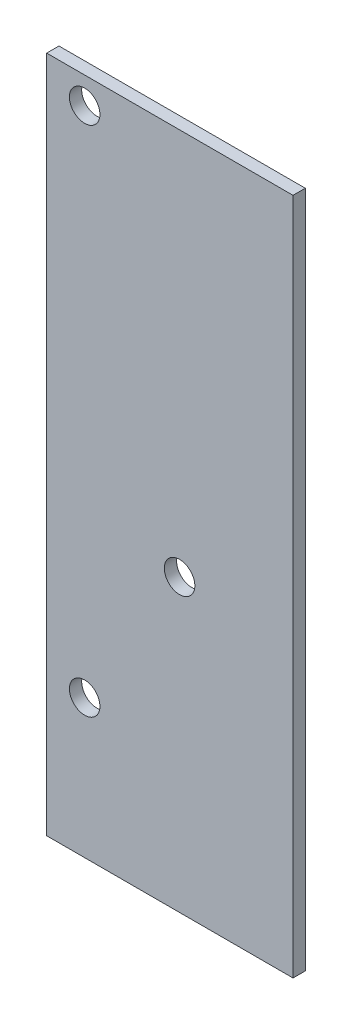
ISO-10303-21;
HEADER;
FILE_DESCRIPTION(('STEP AP214'),'2;1');
FILE_NAME('part.step','',(''),(''),'','','');
FILE_SCHEMA(('AUTOMOTIVE_DESIGN { 1 0 10303 214 1 1 1 1 }'));
ENDSEC;
DATA;
#1=APPLICATION_CONTEXT('core data for automotive mechanical design processes');
#2=APPLICATION_PROTOCOL_DEFINITION('international standard','automotive_design',2000,#1);
#3=PRODUCT_CONTEXT('',#1,'mechanical');
#4=PRODUCT('Part','Part','',(#3));
#5=PRODUCT_RELATED_PRODUCT_CATEGORY('part','',(#4));
#6=PRODUCT_DEFINITION_FORMATION('','',#4);
#7=PRODUCT_DEFINITION_CONTEXT('part definition',#1,'design');
#8=PRODUCT_DEFINITION('design','',#6,#7);
#9=PRODUCT_DEFINITION_SHAPE('','',#8);
#10=(LENGTH_UNIT() NAMED_UNIT(*) SI_UNIT(.MILLI.,.METRE.));
#11=(NAMED_UNIT(*) PLANE_ANGLE_UNIT() SI_UNIT($,.RADIAN.));
#12=(NAMED_UNIT(*) SI_UNIT($,.STERADIAN.) SOLID_ANGLE_UNIT());
#13=UNCERTAINTY_MEASURE_WITH_UNIT(LENGTH_MEASURE(1.E-05),#10,'distance_accuracy_value','');
#14=(GEOMETRIC_REPRESENTATION_CONTEXT(3) GLOBAL_UNCERTAINTY_ASSIGNED_CONTEXT((#13)) GLOBAL_UNIT_ASSIGNED_CONTEXT((#10,
#11,#12)) REPRESENTATION_CONTEXT('',''));
#15=CARTESIAN_POINT('',(0.,0.,0.));
#16=DIRECTION('',(0.,0.,1.));
#17=DIRECTION('',(1.,0.,0.));
#18=AXIS2_PLACEMENT_3D('',#15,#16,#17);
#19=CARTESIAN_POINT('',(-20.5994,-56.6801,2.05486));
#20=DIRECTION('',(1.,0.,0.));
#21=DIRECTION('',(0.,0.,-1.));
#22=AXIS2_PLACEMENT_3D('',#19,#20,#21);
#23=PLANE('',#22);
#24=DIRECTION('',(0.,-1.,0.));
#25=VECTOR('',#24,1.);
#26=CARTESIAN_POINT('',(-20.5994,-56.6801,0.));
#27=LINE('',#26,#25);
#28=CARTESIAN_POINT('',(-20.5994,56.6801,0.));
#29=VERTEX_POINT('',#28);
#30=CARTESIAN_POINT('',(-20.5994,-56.6801,0.));
#31=VERTEX_POINT('',#30);
#32=EDGE_CURVE('E97',#29,#31,#27,.T.);
#33=ORIENTED_EDGE('',*,*,#32,.T.);
#34=DIRECTION('',(0.,0.,-1.));
#35=VECTOR('',#34,1.);
#36=CARTESIAN_POINT('',(-20.5994,-56.6801,2.05486));
#37=LINE('',#36,#35);
#38=CARTESIAN_POINT('',(-20.5994,-56.6801,2.05486));
#39=VERTEX_POINT('',#38);
#40=EDGE_CURVE('E11',#39,#31,#37,.T.);
#41=ORIENTED_EDGE('',*,*,#40,.F.);
#42=DIRECTION('',(0.,-1.,0.));
#43=VECTOR('',#42,1.);
#44=CARTESIAN_POINT('',(-20.5994,-56.6801,2.05486));
#45=LINE('',#44,#43);
#46=CARTESIAN_POINT('',(-20.5994,56.6801,2.05486));
#47=VERTEX_POINT('',#46);
#48=EDGE_CURVE('E85',#47,#39,#45,.T.);
#49=ORIENTED_EDGE('',*,*,#48,.F.);
#50=DIRECTION('',(0.,0.,-1.));
#51=VECTOR('',#50,1.);
#52=CARTESIAN_POINT('',(-20.5994,56.6801,2.05486));
#53=LINE('',#52,#51);
#54=EDGE_CURVE('E93',#47,#29,#53,.T.);
#55=ORIENTED_EDGE('',*,*,#54,.T.);
#56=EDGE_LOOP('',(#33,#41,#49,#55));
#57=FACE_BOUND('',#56,.T.);
#58=ADVANCED_FACE('F34',(#57),#23,.F.);
#59=CARTESIAN_POINT('',(20.5994,-56.6801,2.05486));
#60=DIRECTION('',(0.,1.,0.));
#61=DIRECTION('',(0.,0.,1.));
#62=AXIS2_PLACEMENT_3D('',#59,#60,#61);
#63=PLANE('',#62);
#64=DIRECTION('',(1.,0.,0.));
#65=VECTOR('',#64,1.);
#66=CARTESIAN_POINT('',(20.5994,-56.6801,0.));
#67=LINE('',#66,#65);
#68=CARTESIAN_POINT('',(20.5994,-56.6801,0.));
#69=VERTEX_POINT('',#68);
#70=EDGE_CURVE('E89',#31,#69,#67,.T.);
#71=ORIENTED_EDGE('',*,*,#70,.T.);
#72=DIRECTION('',(0.,0.,-1.));
#73=VECTOR('',#72,1.);
#74=CARTESIAN_POINT('',(20.5994,-56.6801,2.05486));
#75=LINE('',#74,#73);
#76=CARTESIAN_POINT('',(20.5994,-56.6801,2.05486));
#77=VERTEX_POINT('',#76);
#78=EDGE_CURVE('E42',#77,#69,#75,.T.);
#79=ORIENTED_EDGE('',*,*,#78,.F.);
#80=DIRECTION('',(1.,0.,0.));
#81=VECTOR('',#80,1.);
#82=CARTESIAN_POINT('',(20.5994,-56.6801,2.05486));
#83=LINE('',#82,#81);
#84=EDGE_CURVE('E80',#39,#77,#83,.T.);
#85=ORIENTED_EDGE('',*,*,#84,.F.);
#86=ORIENTED_EDGE('',*,*,#40,.T.);
#87=EDGE_LOOP('',(#71,#79,#85,#86));
#88=FACE_BOUND('',#87,.T.);
#89=ADVANCED_FACE('F88',(#88),#63,.F.);
#90=CARTESIAN_POINT('',(20.5994,-56.6801,2.05486));
#91=DIRECTION('',(-1.,0.,0.));
#92=DIRECTION('',(0.,0.,1.));
#93=AXIS2_PLACEMENT_3D('',#90,#91,#92);
#94=PLANE('',#93);
#95=DIRECTION('',(0.,1.,0.));
#96=VECTOR('',#95,1.);
#97=CARTESIAN_POINT('',(20.5994,-56.6801,0.));
#98=LINE('',#97,#96);
#99=CARTESIAN_POINT('',(20.5994,56.6801,0.));
#100=VERTEX_POINT('',#99);
#101=EDGE_CURVE('E67',#69,#100,#98,.T.);
#102=ORIENTED_EDGE('',*,*,#101,.T.);
#103=DIRECTION('',(0.,0.,-1.));
#104=VECTOR('',#103,1.);
#105=CARTESIAN_POINT('',(20.5994,56.6801,2.05486));
#106=LINE('',#105,#104);
#107=CARTESIAN_POINT('',(20.5994,56.6801,2.05486));
#108=VERTEX_POINT('',#107);
#109=EDGE_CURVE('E90',#108,#100,#106,.T.);
#110=ORIENTED_EDGE('',*,*,#109,.F.);
#111=DIRECTION('',(0.,1.,0.));
#112=VECTOR('',#111,1.);
#113=CARTESIAN_POINT('',(20.5994,-56.6801,2.05486));
#114=LINE('',#113,#112);
#115=EDGE_CURVE('E83',#77,#108,#114,.T.);
#116=ORIENTED_EDGE('',*,*,#115,.F.);
#117=ORIENTED_EDGE('',*,*,#78,.T.);
#118=EDGE_LOOP('',(#102,#110,#116,#117));
#119=FACE_BOUND('',#118,.T.);
#120=ADVANCED_FACE('F91',(#119),#94,.F.);
#121=CARTESIAN_POINT('',(20.5994,56.6801,2.05486));
#122=DIRECTION('',(0.,-1.,0.));
#123=DIRECTION('',(0.,0.,-1.));
#124=AXIS2_PLACEMENT_3D('',#121,#122,#123);
#125=PLANE('',#124);
#126=DIRECTION('',(-1.,0.,0.));
#127=VECTOR('',#126,1.);
#128=CARTESIAN_POINT('',(20.5994,56.6801,0.));
#129=LINE('',#128,#127);
#130=EDGE_CURVE('E73',#100,#29,#129,.T.);
#131=ORIENTED_EDGE('',*,*,#130,.T.);
#132=ORIENTED_EDGE('',*,*,#54,.F.);
#133=DIRECTION('',(-1.,0.,0.));
#134=VECTOR('',#133,1.);
#135=CARTESIAN_POINT('',(20.5994,56.6801,2.05486));
#136=LINE('',#135,#134);
#137=EDGE_CURVE('E50',#108,#47,#136,.T.);
#138=ORIENTED_EDGE('',*,*,#137,.F.);
#139=ORIENTED_EDGE('',*,*,#109,.T.);
#140=EDGE_LOOP('',(#131,#132,#138,#139));
#141=FACE_BOUND('',#140,.T.);
#142=ADVANCED_FACE('F105',(#141),#125,.F.);
#143=CARTESIAN_POINT('',(0.,0.,2.05486));
#144=DIRECTION('',(0.,0.,1.));
#145=DIRECTION('',(1.,0.,0.));
#146=AXIS2_PLACEMENT_3D('',#143,#144,#145);
#147=PLANE('',#146);
#148=CARTESIAN_POINT('',(-14.2494,52.2351,2.05486));
#149=DIRECTION('',(0.,0.,1.));
#150=DIRECTION('',(1.,0.,0.));
#151=AXIS2_PLACEMENT_3D('',#148,#149,#150);
#152=CIRCLE('',#151,2.5527);
#153=CARTESIAN_POINT('',(-11.6967,52.2351,2.05486));
#154=VERTEX_POINT('',#153);
#155=EDGE_CURVE('E125',#154,#154,#152,.T.);
#156=ORIENTED_EDGE('',*,*,#155,.F.);
#157=EDGE_LOOP('',(#156));
#158=FACE_BOUND('',#157,.T.);
#159=CARTESIAN_POINT('',(1.6256,-8.08990000000001,2.05486));
#160=DIRECTION('',(0.,0.,1.));
#161=DIRECTION('',(1.,0.,0.));
#162=AXIS2_PLACEMENT_3D('',#159,#160,#161);
#163=CIRCLE('',#162,2.5527);
#164=CARTESIAN_POINT('',(4.1783,-8.08990000000001,2.05486));
#165=VERTEX_POINT('',#164);
#166=EDGE_CURVE('E119',#165,#165,#163,.T.);
#167=ORIENTED_EDGE('',*,*,#166,.F.);
#168=EDGE_LOOP('',(#167));
#169=FACE_BOUND('',#168,.T.);
#170=CARTESIAN_POINT('',(-14.2494,-33.4899,2.05486));
#171=DIRECTION('',(0.,0.,1.));
#172=DIRECTION('',(1.,0.,0.));
#173=AXIS2_PLACEMENT_3D('',#170,#171,#172);
#174=CIRCLE('',#173,2.5527);
#175=CARTESIAN_POINT('',(-11.6967,-33.4899,2.05486));
#176=VERTEX_POINT('',#175);
#177=EDGE_CURVE('E113',#176,#176,#174,.T.);
#178=ORIENTED_EDGE('',*,*,#177,.F.);
#179=EDGE_LOOP('',(#178));
#180=FACE_BOUND('',#179,.T.);
#181=ORIENTED_EDGE('',*,*,#48,.T.);
#182=ORIENTED_EDGE('',*,*,#84,.T.);
#183=ORIENTED_EDGE('',*,*,#115,.T.);
#184=ORIENTED_EDGE('',*,*,#137,.T.);
#185=EDGE_LOOP('',(#181,#182,#183,#184));
#186=FACE_BOUND('',#185,.T.);
#187=ADVANCED_FACE('F81',(#158,#169,#180,#186),#147,.T.);
#188=CARTESIAN_POINT('',(0.,0.,0.));
#189=DIRECTION('',(0.,0.,1.));
#190=DIRECTION('',(1.,0.,0.));
#191=AXIS2_PLACEMENT_3D('',#188,#189,#190);
#192=PLANE('',#191);
#193=CARTESIAN_POINT('',(-14.2494,52.2351,0.));
#194=DIRECTION('',(0.,0.,1.));
#195=DIRECTION('',(1.,0.,0.));
#196=AXIS2_PLACEMENT_3D('',#193,#194,#195);
#197=CIRCLE('',#196,2.5527);
#198=CARTESIAN_POINT('',(-11.6967,52.2351,0.));
#199=VERTEX_POINT('',#198);
#200=EDGE_CURVE('E122',#199,#199,#197,.T.);
#201=ORIENTED_EDGE('',*,*,#200,.T.);
#202=EDGE_LOOP('',(#201));
#203=FACE_BOUND('',#202,.T.);
#204=CARTESIAN_POINT('',(1.6256,-8.08990000000001,0.));
#205=DIRECTION('',(0.,0.,1.));
#206=DIRECTION('',(1.,0.,0.));
#207=AXIS2_PLACEMENT_3D('',#204,#205,#206);
#208=CIRCLE('',#207,2.5527);
#209=CARTESIAN_POINT('',(4.1783,-8.08990000000001,0.));
#210=VERTEX_POINT('',#209);
#211=EDGE_CURVE('E116',#210,#210,#208,.T.);
#212=ORIENTED_EDGE('',*,*,#211,.T.);
#213=EDGE_LOOP('',(#212));
#214=FACE_BOUND('',#213,.T.);
#215=CARTESIAN_POINT('',(-14.2494,-33.4899,0.));
#216=DIRECTION('',(0.,0.,1.));
#217=DIRECTION('',(1.,0.,0.));
#218=AXIS2_PLACEMENT_3D('',#215,#216,#217);
#219=CIRCLE('',#218,2.5527);
#220=CARTESIAN_POINT('',(-11.6967,-33.4899,0.));
#221=VERTEX_POINT('',#220);
#222=EDGE_CURVE('E100',#221,#221,#219,.T.);
#223=ORIENTED_EDGE('',*,*,#222,.T.);
#224=EDGE_LOOP('',(#223));
#225=FACE_BOUND('',#224,.T.);
#226=ORIENTED_EDGE('',*,*,#32,.F.);
#227=ORIENTED_EDGE('',*,*,#130,.F.);
#228=ORIENTED_EDGE('',*,*,#101,.F.);
#229=ORIENTED_EDGE('',*,*,#70,.F.);
#230=EDGE_LOOP('',(#226,#227,#228,#229));
#231=FACE_BOUND('',#230,.T.);
#232=ADVANCED_FACE('F108',(#203,#214,#225,#231),#192,.F.);
#233=CARTESIAN_POINT('',(-14.2494,-33.4899,2.05486));
#234=DIRECTION('',(0.,0.,1.));
#235=DIRECTION('',(1.,0.,0.));
#236=AXIS2_PLACEMENT_3D('',#233,#234,#235);
#237=CYLINDRICAL_SURFACE('',#236,2.5527);
#238=ORIENTED_EDGE('',*,*,#222,.F.);
#239=EDGE_LOOP('',(#238));
#240=FACE_BOUND('',#239,.T.);
#241=ORIENTED_EDGE('',*,*,#177,.T.);
#242=EDGE_LOOP('',(#241));
#243=FACE_BOUND('',#242,.T.);
#244=ADVANCED_FACE('F138',(#240,#243),#237,.F.);
#245=CARTESIAN_POINT('',(1.6256,-8.08990000000001,2.05486));
#246=DIRECTION('',(0.,0.,1.));
#247=DIRECTION('',(1.,0.,0.));
#248=AXIS2_PLACEMENT_3D('',#245,#246,#247);
#249=CYLINDRICAL_SURFACE('',#248,2.5527);
#250=ORIENTED_EDGE('',*,*,#211,.F.);
#251=EDGE_LOOP('',(#250));
#252=FACE_BOUND('',#251,.T.);
#253=ORIENTED_EDGE('',*,*,#166,.T.);
#254=EDGE_LOOP('',(#253));
#255=FACE_BOUND('',#254,.T.);
#256=ADVANCED_FACE('F140',(#252,#255),#249,.F.);
#257=CARTESIAN_POINT('',(-14.2494,52.2351,2.05486));
#258=DIRECTION('',(0.,0.,1.));
#259=DIRECTION('',(1.,0.,0.));
#260=AXIS2_PLACEMENT_3D('',#257,#258,#259);
#261=CYLINDRICAL_SURFACE('',#260,2.5527);
#262=ORIENTED_EDGE('',*,*,#200,.F.);
#263=EDGE_LOOP('',(#262));
#264=FACE_BOUND('',#263,.T.);
#265=ORIENTED_EDGE('',*,*,#155,.T.);
#266=EDGE_LOOP('',(#265));
#267=FACE_BOUND('',#266,.T.);
#268=ADVANCED_FACE('F129',(#264,#267),#261,.F.);
#269=CLOSED_SHELL('',(#58,#89,#120,#142,#187,#232,#244,#256,#268));
#270=MANIFOLD_SOLID_BREP('B2',#269);
#271=ADVANCED_BREP_SHAPE_REPRESENTATION('',(#18,#270),#14);
#272=SHAPE_DEFINITION_REPRESENTATION(#9,#271);
ENDSEC;
END-ISO-10303-21;
